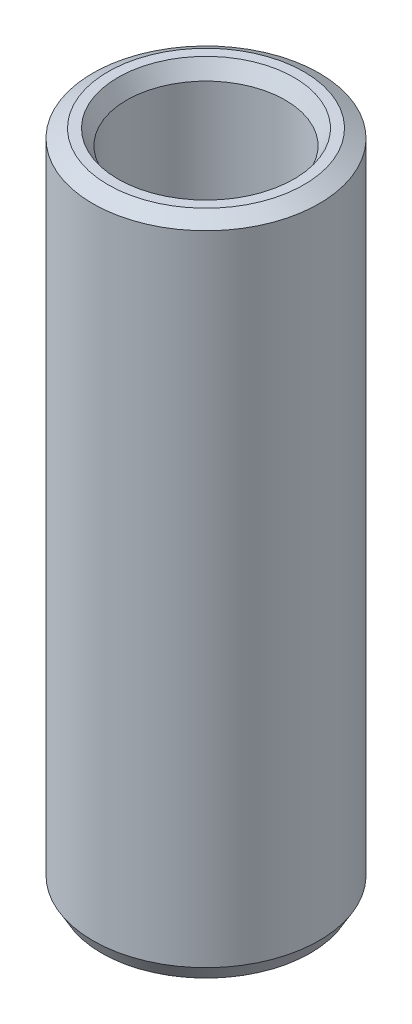
ISO-10303-21;
HEADER;
FILE_DESCRIPTION(('STEP AP214'),'2;1');
FILE_NAME('part.step','',(''),(''),'','','');
FILE_SCHEMA(('AUTOMOTIVE_DESIGN { 1 0 10303 214 1 1 1 1 }'));
ENDSEC;
DATA;
#1=APPLICATION_CONTEXT('core data for automotive mechanical design processes');
#2=APPLICATION_PROTOCOL_DEFINITION('international standard','automotive_design',2000,#1);
#3=PRODUCT_CONTEXT('',#1,'mechanical');
#4=PRODUCT('Part','Part','',(#3));
#5=PRODUCT_RELATED_PRODUCT_CATEGORY('part','',(#4));
#6=PRODUCT_DEFINITION_FORMATION('','',#4);
#7=PRODUCT_DEFINITION_CONTEXT('part definition',#1,'design');
#8=PRODUCT_DEFINITION('design','',#6,#7);
#9=PRODUCT_DEFINITION_SHAPE('','',#8);
#10=(LENGTH_UNIT() NAMED_UNIT(*) SI_UNIT(.MILLI.,.METRE.));
#11=(NAMED_UNIT(*) PLANE_ANGLE_UNIT() SI_UNIT($,.RADIAN.));
#12=(NAMED_UNIT(*) SI_UNIT($,.STERADIAN.) SOLID_ANGLE_UNIT());
#13=UNCERTAINTY_MEASURE_WITH_UNIT(LENGTH_MEASURE(1.E-05),#10,'distance_accuracy_value','');
#14=(GEOMETRIC_REPRESENTATION_CONTEXT(3) GLOBAL_UNCERTAINTY_ASSIGNED_CONTEXT((#13)) GLOBAL_UNIT_ASSIGNED_CONTEXT((#10,
#11,#12)) REPRESENTATION_CONTEXT('',''));
#15=CARTESIAN_POINT('',(0.,0.,0.));
#16=DIRECTION('',(0.,0.,1.));
#17=DIRECTION('',(1.,0.,0.));
#18=AXIS2_PLACEMENT_3D('',#15,#16,#17);
#19=CARTESIAN_POINT('',(0.,292.565962410397,0.));
#20=DIRECTION('',(0.,-1.,0.));
#21=DIRECTION('',(0.,0.,-1.));
#22=AXIS2_PLACEMENT_3D('',#19,#20,#21);
#23=CYLINDRICAL_SURFACE('',#22,50.);
#24=CARTESIAN_POINT('',(0.,6.72112609318992,0.));
#25=DIRECTION('',(0.,1.,0.));
#26=DIRECTION('',(0.,0.,1.));
#27=AXIS2_PLACEMENT_3D('',#24,#25,#26);
#28=CIRCLE('',#27,50.);
#29=CARTESIAN_POINT('',(0.,6.72112609318992,50.));
#30=VERTEX_POINT('',#29);
#31=EDGE_CURVE('E10',#30,#30,#28,.T.);
#32=ORIENTED_EDGE('',*,*,#31,.T.);
#33=EDGE_LOOP('',(#32));
#34=FACE_BOUND('',#33,.T.);
#35=CARTESIAN_POINT('',(0.,288.685518451237,0.));
#36=DIRECTION('',(0.,1.,0.));
#37=DIRECTION('',(0.,0.,1.));
#38=AXIS2_PLACEMENT_3D('',#35,#36,#37);
#39=CIRCLE('',#38,50.);
#40=CARTESIAN_POINT('',(0.,288.685518451237,50.));
#41=VERTEX_POINT('',#40);
#42=EDGE_CURVE('E50',#41,#41,#39,.F.);
#43=ORIENTED_EDGE('',*,*,#42,.T.);
#44=EDGE_LOOP('',(#43));
#45=FACE_BOUND('',#44,.T.);
#46=ADVANCED_FACE('F39',(#34,#45),#23,.T.);
#47=CARTESIAN_POINT('',(0.,292.565962410397,0.));
#48=DIRECTION('',(0.,1.,0.));
#49=DIRECTION('',(0.,0.,1.));
#50=AXIS2_PLACEMENT_3D('',#47,#48,#49);
#51=PLANE('',#50);
#52=CARTESIAN_POINT('',(0.,292.565962410397,0.));
#53=DIRECTION('',(0.,1.,0.));
#54=DIRECTION('',(0.,0.,1.));
#55=AXIS2_PLACEMENT_3D('',#52,#53,#54);
#56=CIRCLE('',#55,38.9061455338669);
#57=CARTESIAN_POINT('',(0.,292.565962410397,38.9061455338669));
#58=VERTEX_POINT('',#57);
#59=EDGE_CURVE('E58',#58,#58,#56,.F.);
#60=ORIENTED_EDGE('',*,*,#59,.T.);
#61=EDGE_LOOP('',(#60));
#62=FACE_BOUND('',#61,.T.);
#63=CARTESIAN_POINT('',(0.,292.565962410397,0.));
#64=DIRECTION('',(0.,1.,0.));
#65=DIRECTION('',(0.,0.,1.));
#66=AXIS2_PLACEMENT_3D('',#63,#64,#65);
#67=CIRCLE('',#66,43.2788739068101);
#68=CARTESIAN_POINT('',(0.,292.565962410397,43.2788739068101));
#69=VERTEX_POINT('',#68);
#70=EDGE_CURVE('E61',#69,#69,#67,.T.);
#71=ORIENTED_EDGE('',*,*,#70,.T.);
#72=EDGE_LOOP('',(#71));
#73=FACE_BOUND('',#72,.T.);
#74=ADVANCED_FACE('F88',(#62,#73),#51,.T.);
#75=CARTESIAN_POINT('',(0.,0.,0.));
#76=DIRECTION('',(0.,1.,0.));
#77=DIRECTION('',(0.,0.,1.));
#78=AXIS2_PLACEMENT_3D('',#75,#76,#77);
#79=PLANE('',#78);
#80=CARTESIAN_POINT('',(0.,0.,0.));
#81=DIRECTION('',(0.,1.,0.));
#82=DIRECTION('',(0.,0.,1.));
#83=AXIS2_PLACEMENT_3D('',#80,#81,#82);
#84=CIRCLE('',#83,41.7468276678961);
#85=CARTESIAN_POINT('',(0.,0.,41.7468276678961));
#86=VERTEX_POINT('',#85);
#87=EDGE_CURVE('E51',#86,#86,#84,.T.);
#88=ORIENTED_EDGE('',*,*,#87,.T.);
#89=EDGE_LOOP('',(#88));
#90=FACE_BOUND('',#89,.T.);
#91=CARTESIAN_POINT('',(0.,0.,0.));
#92=DIRECTION('',(0.,1.,0.));
#93=DIRECTION('',(0.,0.,1.));
#94=AXIS2_PLACEMENT_3D('',#91,#92,#93);
#95=CIRCLE('',#94,46.1195560408393);
#96=CARTESIAN_POINT('',(0.,0.,46.1195560408393));
#97=VERTEX_POINT('',#96);
#98=EDGE_CURVE('E54',#97,#97,#95,.F.);
#99=ORIENTED_EDGE('',*,*,#98,.T.);
#100=EDGE_LOOP('',(#99));
#101=FACE_BOUND('',#100,.T.);
#102=ADVANCED_FACE('F83',(#90,#101),#79,.F.);
#103=CARTESIAN_POINT('',(0.,292.565962410397,0.));
#104=DIRECTION('',(0.,-1.,0.));
#105=DIRECTION('',(0.,0.,-1.));
#106=AXIS2_PLACEMENT_3D('',#103,#104,#105);
#107=CYLINDRICAL_SURFACE('',#106,35.0257015747061);
#108=CARTESIAN_POINT('',(0.,285.844836317207,0.));
#109=DIRECTION('',(0.,1.,0.));
#110=DIRECTION('',(0.,0.,1.));
#111=AXIS2_PLACEMENT_3D('',#108,#109,#110);
#112=CIRCLE('',#111,35.0257015747061);
#113=CARTESIAN_POINT('',(0.,285.844836317207,35.0257015747061));
#114=VERTEX_POINT('',#113);
#115=EDGE_CURVE('E67',#114,#114,#112,.T.);
#116=ORIENTED_EDGE('',*,*,#115,.T.);
#117=EDGE_LOOP('',(#116));
#118=FACE_BOUND('',#117,.T.);
#119=CARTESIAN_POINT('',(0.,3.88044395916071,0.));
#120=DIRECTION('',(0.,1.,0.));
#121=DIRECTION('',(0.,0.,1.));
#122=AXIS2_PLACEMENT_3D('',#119,#120,#121);
#123=CIRCLE('',#122,35.0257015747061);
#124=CARTESIAN_POINT('',(0.,3.88044395916071,35.0257015747061));
#125=VERTEX_POINT('',#124);
#126=EDGE_CURVE('E69',#125,#125,#123,.F.);
#127=ORIENTED_EDGE('',*,*,#126,.T.);
#128=EDGE_LOOP('',(#127));
#129=FACE_BOUND('',#128,.T.);
#130=ADVANCED_FACE('F71',(#118,#129),#107,.F.);
#131=CARTESIAN_POINT('',(0.,285.844836317207,0.));
#132=DIRECTION('',(0.,1.,0.));
#133=DIRECTION('',(0.,0.,1.));
#134=AXIS2_PLACEMENT_3D('',#131,#132,#133);
#135=CONICAL_SURFACE('',#134,35.0257015747061,0.523598775598301);
#136=ORIENTED_EDGE('',*,*,#59,.F.);
#137=EDGE_LOOP('',(#136));
#138=FACE_BOUND('',#137,.T.);
#139=ORIENTED_EDGE('',*,*,#115,.F.);
#140=EDGE_LOOP('',(#139));
#141=FACE_BOUND('',#140,.T.);
#142=ADVANCED_FACE('F77',(#138,#141),#135,.F.);
#143=CARTESIAN_POINT('',(0.,0.,0.));
#144=DIRECTION('',(0.,-1.,0.));
#145=DIRECTION('',(0.,0.,-1.));
#146=AXIS2_PLACEMENT_3D('',#143,#144,#145);
#147=CONICAL_SURFACE('',#146,41.7468276678961,1.04719755119659);
#148=ORIENTED_EDGE('',*,*,#126,.F.);
#149=EDGE_LOOP('',(#148));
#150=FACE_BOUND('',#149,.T.);
#151=ORIENTED_EDGE('',*,*,#87,.F.);
#152=EDGE_LOOP('',(#151));
#153=FACE_BOUND('',#152,.T.);
#154=ADVANCED_FACE('F73',(#150,#153),#147,.F.);
#155=CARTESIAN_POINT('',(0.,6.72112609318992,0.));
#156=DIRECTION('',(0.,1.,0.));
#157=DIRECTION('',(0.,0.,1.));
#158=AXIS2_PLACEMENT_3D('',#155,#156,#157);
#159=CONICAL_SURFACE('',#158,50.,0.523598775598304);
#160=ORIENTED_EDGE('',*,*,#98,.F.);
#161=EDGE_LOOP('',(#160));
#162=FACE_BOUND('',#161,.T.);
#163=ORIENTED_EDGE('',*,*,#31,.F.);
#164=EDGE_LOOP('',(#163));
#165=FACE_BOUND('',#164,.T.);
#166=ADVANCED_FACE('F76',(#162,#165),#159,.T.);
#167=CARTESIAN_POINT('',(0.,292.565962410397,0.));
#168=DIRECTION('',(0.,-1.,0.));
#169=DIRECTION('',(0.,0.,-1.));
#170=AXIS2_PLACEMENT_3D('',#167,#168,#169);
#171=CONICAL_SURFACE('',#170,43.2788739068101,1.04719755119659);
#172=ORIENTED_EDGE('',*,*,#42,.F.);
#173=EDGE_LOOP('',(#172));
#174=FACE_BOUND('',#173,.T.);
#175=ORIENTED_EDGE('',*,*,#70,.F.);
#176=EDGE_LOOP('',(#175));
#177=FACE_BOUND('',#176,.T.);
#178=ADVANCED_FACE('F45',(#174,#177),#171,.T.);
#179=CLOSED_SHELL('',(#46,#74,#102,#130,#142,#154,#166,#178));
#180=MANIFOLD_SOLID_BREP('B2',#179);
#181=ADVANCED_BREP_SHAPE_REPRESENTATION('',(#18,#180),#14);
#182=SHAPE_DEFINITION_REPRESENTATION(#9,#181);
ENDSEC;
END-ISO-10303-21;
